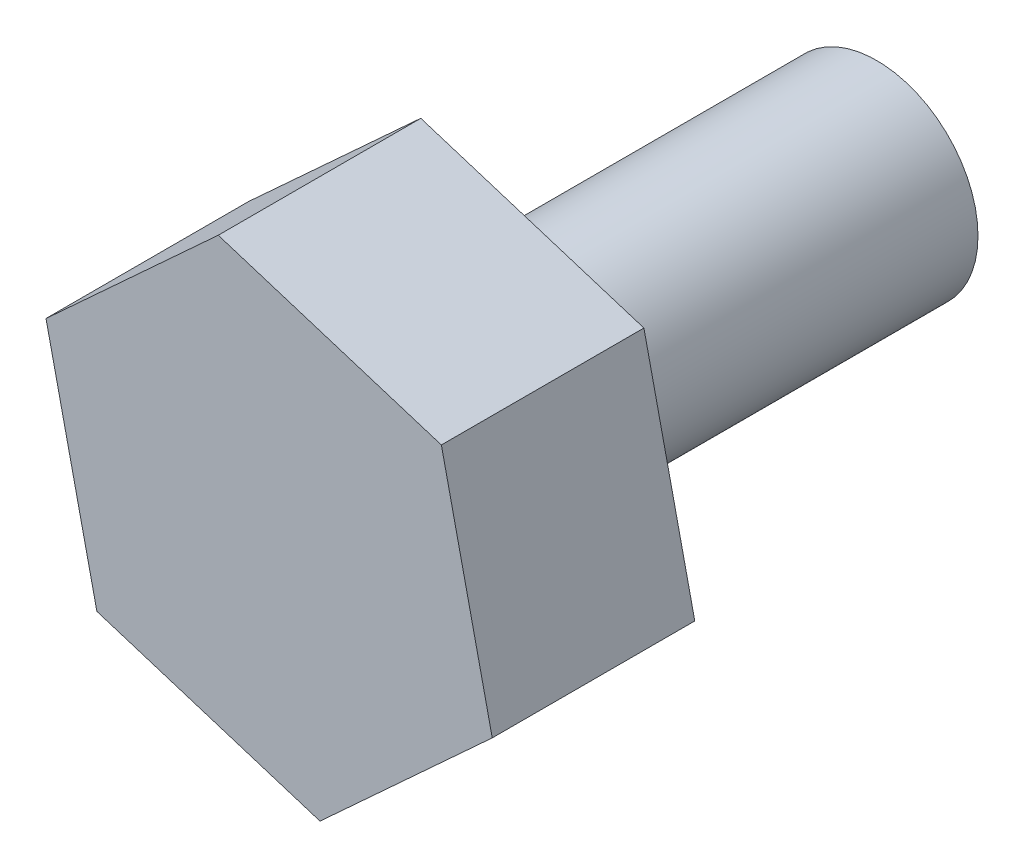
ISO-10303-21;
HEADER;
FILE_DESCRIPTION(('STEP AP214'),'2;1');
FILE_NAME('part.step','',(''),(''),'','','');
FILE_SCHEMA(('AUTOMOTIVE_DESIGN { 1 0 10303 214 1 1 1 1 }'));
ENDSEC;
DATA;
#1=APPLICATION_CONTEXT('core data for automotive mechanical design processes');
#2=APPLICATION_PROTOCOL_DEFINITION('international standard','automotive_design',2000,#1);
#3=PRODUCT_CONTEXT('',#1,'mechanical');
#4=PRODUCT('Part','Part','',(#3));
#5=PRODUCT_RELATED_PRODUCT_CATEGORY('part','',(#4));
#6=PRODUCT_DEFINITION_FORMATION('','',#4);
#7=PRODUCT_DEFINITION_CONTEXT('part definition',#1,'design');
#8=PRODUCT_DEFINITION('design','',#6,#7);
#9=PRODUCT_DEFINITION_SHAPE('','',#8);
#10=(LENGTH_UNIT() NAMED_UNIT(*) SI_UNIT(.MILLI.,.METRE.));
#11=(NAMED_UNIT(*) PLANE_ANGLE_UNIT() SI_UNIT($,.RADIAN.));
#12=(NAMED_UNIT(*) SI_UNIT($,.STERADIAN.) SOLID_ANGLE_UNIT());
#13=UNCERTAINTY_MEASURE_WITH_UNIT(LENGTH_MEASURE(1.E-05),#10,'distance_accuracy_value','');
#14=(GEOMETRIC_REPRESENTATION_CONTEXT(3) GLOBAL_UNCERTAINTY_ASSIGNED_CONTEXT((#13)) GLOBAL_UNIT_ASSIGNED_CONTEXT((#10,
#11,#12)) REPRESENTATION_CONTEXT('',''));
#15=CARTESIAN_POINT('',(0.,0.,0.));
#16=DIRECTION('',(0.,0.,1.));
#17=DIRECTION('',(1.,0.,0.));
#18=AXIS2_PLACEMENT_3D('',#15,#16,#17);
#19=CARTESIAN_POINT('',(0.502480901469338,-2.25407326344817,0.));
#20=DIRECTION('',(0.,0.,1.));
#21=DIRECTION('',(1.,0.,0.));
#22=AXIS2_PLACEMENT_3D('',#19,#20,#21);
#23=PLANE('',#22);
#24=DIRECTION('',(0.954067780190303,-0.299590838983351,0.));
#25=VECTOR('',#24,1.);
#26=CARTESIAN_POINT('',(-1.70084425740274,-1.56219785731304,0.));
#27=LINE('',#26,#25);
#28=CARTESIAN_POINT('',(-1.70084425740274,-1.56219785731304,0.));
#29=VERTEX_POINT('',#28);
#30=CARTESIAN_POINT('',(0.502480901469338,-2.25407326344817,0.));
#31=VERTEX_POINT('',#30);
#32=EDGE_CURVE('E117',#29,#31,#27,.T.);
#33=ORIENTED_EDGE('',*,*,#32,.F.);
#34=DIRECTION('',(0.217580612794476,-0.976042354068706,0.));
#35=VECTOR('',#34,1.);
#36=CARTESIAN_POINT('',(-2.20332515887208,0.691875406135135,0.));
#37=LINE('',#36,#35);
#38=CARTESIAN_POINT('',(-2.20332515887208,0.691875406135135,0.));
#39=VERTEX_POINT('',#38);
#40=EDGE_CURVE('E77',#39,#29,#37,.T.);
#41=ORIENTED_EDGE('',*,*,#40,.F.);
#42=DIRECTION('',(-0.736487167395827,-0.676451515085355,0.));
#43=VECTOR('',#42,1.);
#44=CARTESIAN_POINT('',(-0.502480901469338,2.25407326344817,0.));
#45=LINE('',#44,#43);
#46=CARTESIAN_POINT('',(-0.502480901469338,2.25407326344817,0.));
#47=VERTEX_POINT('',#46);
#48=EDGE_CURVE('E71',#47,#39,#45,.T.);
#49=ORIENTED_EDGE('',*,*,#48,.F.);
#50=DIRECTION('',(-0.954067780190303,0.299590838983351,0.));
#51=VECTOR('',#50,1.);
#52=CARTESIAN_POINT('',(1.70084425740274,1.56219785731304,0.));
#53=LINE('',#52,#51);
#54=CARTESIAN_POINT('',(1.70084425740274,1.56219785731304,0.));
#55=VERTEX_POINT('',#54);
#56=EDGE_CURVE('E107',#55,#47,#53,.T.);
#57=ORIENTED_EDGE('',*,*,#56,.F.);
#58=DIRECTION('',(-0.217580612794476,0.976042354068706,0.));
#59=VECTOR('',#58,1.);
#60=CARTESIAN_POINT('',(2.20332515887208,-0.691875406135134,0.));
#61=LINE('',#60,#59);
#62=CARTESIAN_POINT('',(2.20332515887208,-0.691875406135134,0.));
#63=VERTEX_POINT('',#62);
#64=EDGE_CURVE('E123',#63,#55,#61,.T.);
#65=ORIENTED_EDGE('',*,*,#64,.F.);
#66=DIRECTION('',(0.736487167395826,0.676451515085355,0.));
#67=VECTOR('',#66,1.);
#68=CARTESIAN_POINT('',(0.502480901469338,-2.25407326344817,0.));
#69=LINE('',#68,#67);
#70=EDGE_CURVE('E120',#31,#63,#69,.T.);
#71=ORIENTED_EDGE('',*,*,#70,.F.);
#72=EDGE_LOOP('',(#33,#41,#49,#57,#65,#71));
#73=FACE_BOUND('',#72,.T.);
#74=CARTESIAN_POINT('',(0.,0.,0.));
#75=DIRECTION('',(0.,0.,1.));
#76=DIRECTION('',(1.,0.,0.));
#77=AXIS2_PLACEMENT_3D('',#74,#75,#76);
#78=CIRCLE('',#77,1.);
#79=CARTESIAN_POINT('',(1.,0.,0.));
#80=VERTEX_POINT('',#79);
#81=EDGE_CURVE('E11',#80,#80,#78,.F.);
#82=ORIENTED_EDGE('',*,*,#81,.F.);
#83=EDGE_LOOP('',(#82));
#84=FACE_BOUND('',#83,.T.);
#85=ADVANCED_FACE('F31',(#73,#84),#23,.F.);
#86=CARTESIAN_POINT('',(-1.70084425740274,-1.56219785731304,2.));
#87=DIRECTION('',(0.299590838983351,0.954067780190303,0.));
#88=DIRECTION('',(-0.954067780190303,0.299590838983351,0.));
#89=AXIS2_PLACEMENT_3D('',#86,#87,#88);
#90=PLANE('',#89);
#91=ORIENTED_EDGE('',*,*,#32,.T.);
#92=DIRECTION('',(0.,0.,-1.));
#93=VECTOR('',#92,1.);
#94=CARTESIAN_POINT('',(0.502480901469338,-2.25407326344817,2.));
#95=LINE('',#94,#93);
#96=CARTESIAN_POINT('',(0.502480901469338,-2.25407326344817,2.));
#97=VERTEX_POINT('',#96);
#98=EDGE_CURVE('E40',#97,#31,#95,.T.);
#99=ORIENTED_EDGE('',*,*,#98,.F.);
#100=DIRECTION('',(0.954067780190303,-0.299590838983351,0.));
#101=VECTOR('',#100,1.);
#102=CARTESIAN_POINT('',(-1.70084425740274,-1.56219785731304,2.));
#103=LINE('',#102,#101);
#104=CARTESIAN_POINT('',(-1.70084425740274,-1.56219785731304,2.));
#105=VERTEX_POINT('',#104);
#106=EDGE_CURVE('E128',#105,#97,#103,.T.);
#107=ORIENTED_EDGE('',*,*,#106,.F.);
#108=DIRECTION('',(0.,0.,-1.));
#109=VECTOR('',#108,1.);
#110=CARTESIAN_POINT('',(-1.70084425740274,-1.56219785731304,2.));
#111=LINE('',#110,#109);
#112=EDGE_CURVE('E113',#105,#29,#111,.T.);
#113=ORIENTED_EDGE('',*,*,#112,.T.);
#114=EDGE_LOOP('',(#91,#99,#107,#113));
#115=FACE_BOUND('',#114,.T.);
#116=ADVANCED_FACE('F33',(#115),#90,.F.);
#117=CARTESIAN_POINT('',(0.502480901469338,-2.25407326344817,2.));
#118=DIRECTION('',(-0.676451515085355,0.736487167395827,0.));
#119=DIRECTION('',(-0.736487167395827,-0.676451515085355,0.));
#120=AXIS2_PLACEMENT_3D('',#117,#118,#119);
#121=PLANE('',#120);
#122=ORIENTED_EDGE('',*,*,#70,.T.);
#123=DIRECTION('',(0.,0.,-1.));
#124=VECTOR('',#123,1.);
#125=CARTESIAN_POINT('',(2.20332515887208,-0.691875406135134,2.));
#126=LINE('',#125,#124);
#127=CARTESIAN_POINT('',(2.20332515887208,-0.691875406135134,2.));
#128=VERTEX_POINT('',#127);
#129=EDGE_CURVE('E132',#128,#63,#126,.T.);
#130=ORIENTED_EDGE('',*,*,#129,.F.);
#131=DIRECTION('',(0.736487167395826,0.676451515085355,0.));
#132=VECTOR('',#131,1.);
#133=CARTESIAN_POINT('',(0.502480901469338,-2.25407326344817,2.));
#134=LINE('',#133,#132);
#135=EDGE_CURVE('E86',#97,#128,#134,.T.);
#136=ORIENTED_EDGE('',*,*,#135,.F.);
#137=ORIENTED_EDGE('',*,*,#98,.T.);
#138=EDGE_LOOP('',(#122,#130,#136,#137));
#139=FACE_BOUND('',#138,.T.);
#140=ADVANCED_FACE('F135',(#139),#121,.F.);
#141=CARTESIAN_POINT('',(2.20332515887208,-0.691875406135134,2.));
#142=DIRECTION('',(-0.976042354068706,-0.217580612794476,0.));
#143=DIRECTION('',(0.217580612794476,-0.976042354068706,0.));
#144=AXIS2_PLACEMENT_3D('',#141,#142,#143);
#145=PLANE('',#144);
#146=ORIENTED_EDGE('',*,*,#64,.T.);
#147=DIRECTION('',(0.,0.,-1.));
#148=VECTOR('',#147,1.);
#149=CARTESIAN_POINT('',(1.70084425740274,1.56219785731304,2.));
#150=LINE('',#149,#148);
#151=CARTESIAN_POINT('',(1.70084425740274,1.56219785731304,2.));
#152=VERTEX_POINT('',#151);
#153=EDGE_CURVE('E108',#152,#55,#150,.T.);
#154=ORIENTED_EDGE('',*,*,#153,.F.);
#155=DIRECTION('',(-0.217580612794476,0.976042354068706,0.));
#156=VECTOR('',#155,1.);
#157=CARTESIAN_POINT('',(2.20332515887208,-0.691875406135134,2.));
#158=LINE('',#157,#156);
#159=EDGE_CURVE('E99',#128,#152,#158,.T.);
#160=ORIENTED_EDGE('',*,*,#159,.F.);
#161=ORIENTED_EDGE('',*,*,#129,.T.);
#162=EDGE_LOOP('',(#146,#154,#160,#161));
#163=FACE_BOUND('',#162,.T.);
#164=ADVANCED_FACE('F143',(#163),#145,.F.);
#165=CARTESIAN_POINT('',(1.70084425740274,1.56219785731304,2.));
#166=DIRECTION('',(-0.299590838983351,-0.954067780190303,0.));
#167=DIRECTION('',(0.954067780190303,-0.299590838983351,0.));
#168=AXIS2_PLACEMENT_3D('',#165,#166,#167);
#169=PLANE('',#168);
#170=ORIENTED_EDGE('',*,*,#56,.T.);
#171=DIRECTION('',(0.,0.,-1.));
#172=VECTOR('',#171,1.);
#173=CARTESIAN_POINT('',(-0.502480901469338,2.25407326344817,2.));
#174=LINE('',#173,#172);
#175=CARTESIAN_POINT('',(-0.502480901469338,2.25407326344817,2.));
#176=VERTEX_POINT('',#175);
#177=EDGE_CURVE('E104',#176,#47,#174,.T.);
#178=ORIENTED_EDGE('',*,*,#177,.F.);
#179=DIRECTION('',(-0.954067780190303,0.299590838983351,0.));
#180=VECTOR('',#179,1.);
#181=CARTESIAN_POINT('',(1.70084425740274,1.56219785731304,2.));
#182=LINE('',#181,#180);
#183=EDGE_CURVE('E93',#152,#176,#182,.T.);
#184=ORIENTED_EDGE('',*,*,#183,.F.);
#185=ORIENTED_EDGE('',*,*,#153,.T.);
#186=EDGE_LOOP('',(#170,#178,#184,#185));
#187=FACE_BOUND('',#186,.T.);
#188=ADVANCED_FACE('F105',(#187),#169,.F.);
#189=CARTESIAN_POINT('',(-0.502480901469338,2.25407326344817,2.));
#190=DIRECTION('',(0.676451515085355,-0.736487167395827,0.));
#191=DIRECTION('',(0.736487167395827,0.676451515085355,0.));
#192=AXIS2_PLACEMENT_3D('',#189,#190,#191);
#193=PLANE('',#192);
#194=ORIENTED_EDGE('',*,*,#48,.T.);
#195=DIRECTION('',(0.,0.,-1.));
#196=VECTOR('',#195,1.);
#197=CARTESIAN_POINT('',(-2.20332515887208,0.691875406135135,2.));
#198=LINE('',#197,#196);
#199=CARTESIAN_POINT('',(-2.20332515887208,0.691875406135135,2.));
#200=VERTEX_POINT('',#199);
#201=EDGE_CURVE('E109',#200,#39,#198,.T.);
#202=ORIENTED_EDGE('',*,*,#201,.F.);
#203=DIRECTION('',(-0.736487167395827,-0.676451515085355,0.));
#204=VECTOR('',#203,1.);
#205=CARTESIAN_POINT('',(-0.502480901469338,2.25407326344817,2.));
#206=LINE('',#205,#204);
#207=EDGE_CURVE('E97',#176,#200,#206,.T.);
#208=ORIENTED_EDGE('',*,*,#207,.F.);
#209=ORIENTED_EDGE('',*,*,#177,.T.);
#210=EDGE_LOOP('',(#194,#202,#208,#209));
#211=FACE_BOUND('',#210,.T.);
#212=ADVANCED_FACE('F111',(#211),#193,.F.);
#213=CARTESIAN_POINT('',(-2.20332515887208,0.691875406135135,2.));
#214=DIRECTION('',(0.976042354068706,0.217580612794476,0.));
#215=DIRECTION('',(-0.217580612794476,0.976042354068706,0.));
#216=AXIS2_PLACEMENT_3D('',#213,#214,#215);
#217=PLANE('',#216);
#218=ORIENTED_EDGE('',*,*,#40,.T.);
#219=ORIENTED_EDGE('',*,*,#112,.F.);
#220=DIRECTION('',(0.217580612794476,-0.976042354068706,0.));
#221=VECTOR('',#220,1.);
#222=CARTESIAN_POINT('',(-2.20332515887208,0.691875406135135,2.));
#223=LINE('',#222,#221);
#224=EDGE_CURVE('E48',#200,#105,#223,.T.);
#225=ORIENTED_EDGE('',*,*,#224,.F.);
#226=ORIENTED_EDGE('',*,*,#201,.T.);
#227=EDGE_LOOP('',(#218,#219,#225,#226));
#228=FACE_BOUND('',#227,.T.);
#229=ADVANCED_FACE('F164',(#228),#217,.F.);
#230=CARTESIAN_POINT('',(0.502480901469338,-2.25407326344817,2.));
#231=DIRECTION('',(0.,0.,1.));
#232=DIRECTION('',(1.,0.,0.));
#233=AXIS2_PLACEMENT_3D('',#230,#231,#232);
#234=PLANE('',#233);
#235=ORIENTED_EDGE('',*,*,#106,.T.);
#236=ORIENTED_EDGE('',*,*,#135,.T.);
#237=ORIENTED_EDGE('',*,*,#159,.T.);
#238=ORIENTED_EDGE('',*,*,#183,.T.);
#239=ORIENTED_EDGE('',*,*,#207,.T.);
#240=ORIENTED_EDGE('',*,*,#224,.T.);
#241=EDGE_LOOP('',(#235,#236,#237,#238,#239,#240));
#242=FACE_BOUND('',#241,.T.);
#243=ADVANCED_FACE('F95',(#242),#234,.T.);
#244=CARTESIAN_POINT('',(0.,0.,-4.));
#245=DIRECTION('',(0.,0.,1.));
#246=DIRECTION('',(1.,0.,0.));
#247=AXIS2_PLACEMENT_3D('',#244,#245,#246);
#248=CYLINDRICAL_SURFACE('',#247,1.);
#249=CARTESIAN_POINT('',(0.,0.,-4.));
#250=DIRECTION('',(0.,0.,-1.));
#251=DIRECTION('',(-1.,0.,0.));
#252=AXIS2_PLACEMENT_3D('',#249,#250,#251);
#253=CIRCLE('',#252,1.);
#254=CARTESIAN_POINT('',(-1.,0.,-4.));
#255=VERTEX_POINT('',#254);
#256=EDGE_CURVE('E121',#255,#255,#253,.T.);
#257=ORIENTED_EDGE('',*,*,#256,.F.);
#258=EDGE_LOOP('',(#257));
#259=FACE_BOUND('',#258,.T.);
#260=ORIENTED_EDGE('',*,*,#81,.T.);
#261=EDGE_LOOP('',(#260));
#262=FACE_BOUND('',#261,.T.);
#263=ADVANCED_FACE('F152',(#259,#262),#248,.T.);
#264=CARTESIAN_POINT('',(0.,0.,-4.));
#265=DIRECTION('',(0.,0.,-1.));
#266=DIRECTION('',(-1.,0.,0.));
#267=AXIS2_PLACEMENT_3D('',#264,#265,#266);
#268=PLANE('',#267);
#269=ORIENTED_EDGE('',*,*,#256,.T.);
#270=EDGE_LOOP('',(#269));
#271=FACE_BOUND('',#270,.T.);
#272=ADVANCED_FACE('F150',(#271),#268,.T.);
#273=CLOSED_SHELL('',(#85,#116,#140,#164,#188,#212,#229,#243,#263,#272));
#274=MANIFOLD_SOLID_BREP('B2',#273);
#275=ADVANCED_BREP_SHAPE_REPRESENTATION('',(#18,#274),#14);
#276=SHAPE_DEFINITION_REPRESENTATION(#9,#275);
ENDSEC;
END-ISO-10303-21;
